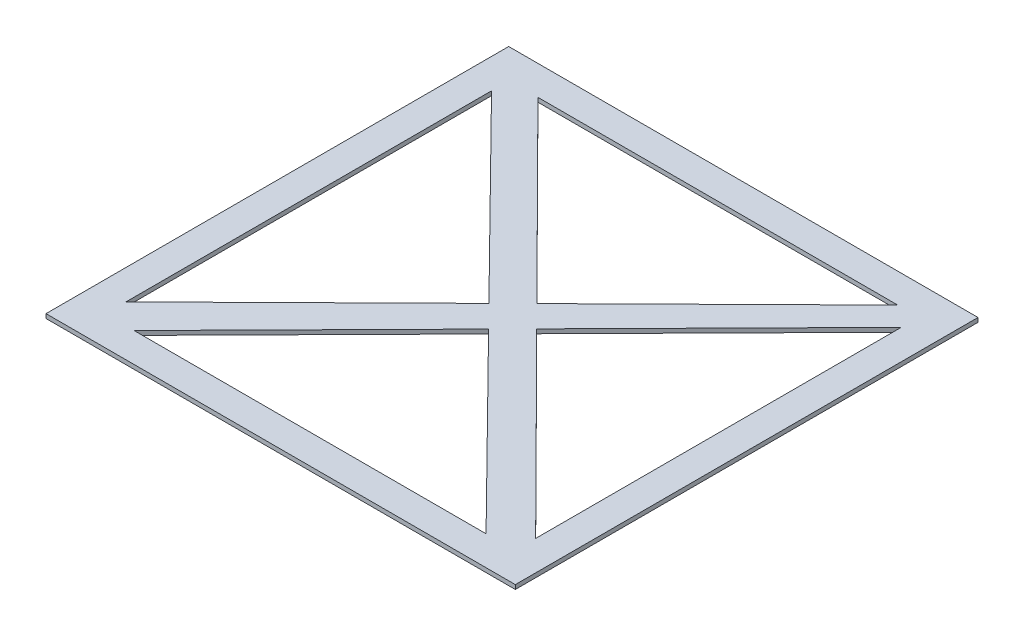
ISO-10303-21;
HEADER;
FILE_DESCRIPTION(('STEP AP214'),'2;1');
FILE_NAME('part.step','',(''),(''),'','','');
FILE_SCHEMA(('AUTOMOTIVE_DESIGN { 1 0 10303 214 1 1 1 1 }'));
ENDSEC;
DATA;
#1=APPLICATION_CONTEXT('core data for automotive mechanical design processes');
#2=APPLICATION_PROTOCOL_DEFINITION('international standard','automotive_design',2000,#1);
#3=PRODUCT_CONTEXT('',#1,'mechanical');
#4=PRODUCT('Part','Part','',(#3));
#5=PRODUCT_RELATED_PRODUCT_CATEGORY('part','',(#4));
#6=PRODUCT_DEFINITION_FORMATION('','',#4);
#7=PRODUCT_DEFINITION_CONTEXT('part definition',#1,'design');
#8=PRODUCT_DEFINITION('design','',#6,#7);
#9=PRODUCT_DEFINITION_SHAPE('','',#8);
#10=(LENGTH_UNIT() NAMED_UNIT(*) SI_UNIT(.MILLI.,.METRE.));
#11=(NAMED_UNIT(*) PLANE_ANGLE_UNIT() SI_UNIT($,.RADIAN.));
#12=(NAMED_UNIT(*) SI_UNIT($,.STERADIAN.) SOLID_ANGLE_UNIT());
#13=UNCERTAINTY_MEASURE_WITH_UNIT(LENGTH_MEASURE(1.E-05),#10,'distance_accuracy_value','');
#14=(GEOMETRIC_REPRESENTATION_CONTEXT(3) GLOBAL_UNCERTAINTY_ASSIGNED_CONTEXT((#13)) GLOBAL_UNIT_ASSIGNED_CONTEXT((#10,
#11,#12)) REPRESENTATION_CONTEXT('',''));
#15=CARTESIAN_POINT('',(0.,0.,0.));
#16=DIRECTION('',(0.,0.,1.));
#17=DIRECTION('',(1.,0.,0.));
#18=AXIS2_PLACEMENT_3D('',#15,#16,#17);
#19=CARTESIAN_POINT('',(0.,20.,0.));
#20=DIRECTION('',(0.,1.,0.));
#21=DIRECTION('',(0.,0.,1.));
#22=AXIS2_PLACEMENT_3D('',#19,#20,#21);
#23=PLANE('',#22);
#24=DIRECTION('',(-1.,0.,0.));
#25=VECTOR('',#24,1.);
#26=CARTESIAN_POINT('',(903.618826821277,20.,-970.686446865544));
#27=LINE('',#26,#25);
#28=CARTESIAN_POINT('',(903.618826821277,20.,-970.686446865544));
#29=VERTEX_POINT('',#28);
#30=CARTESIAN_POINT('',(-1306.34674750349,20.,-970.686446865543));
#31=VERTEX_POINT('',#30);
#32=EDGE_CURVE('E248',#29,#31,#27,.T.);
#33=ORIENTED_EDGE('',*,*,#32,.T.);
#34=DIRECTION('',(0.,0.,1.));
#35=VECTOR('',#34,1.);
#36=CARTESIAN_POINT('',(-1306.34674750349,20.,-970.686446865543));
#37=LINE('',#36,#35);
#38=CARTESIAN_POINT('',(-1306.34674750349,20.,1207.97064135837));
#39=VERTEX_POINT('',#38);
#40=EDGE_CURVE('E251',#31,#39,#37,.T.);
#41=ORIENTED_EDGE('',*,*,#40,.T.);
#42=DIRECTION('',(1.,0.,0.));
#43=VECTOR('',#42,1.);
#44=CARTESIAN_POINT('',(-1306.34674750349,20.,1207.97064135837));
#45=LINE('',#44,#43);
#46=CARTESIAN_POINT('',(903.618826821277,20.,1207.97064135837));
#47=VERTEX_POINT('',#46);
#48=EDGE_CURVE('E254',#39,#47,#45,.T.);
#49=ORIENTED_EDGE('',*,*,#48,.T.);
#50=DIRECTION('',(0.,0.,-1.));
#51=VECTOR('',#50,1.);
#52=CARTESIAN_POINT('',(903.618826821277,20.,1207.97064135837));
#53=LINE('',#52,#51);
#54=EDGE_CURVE('E256',#47,#29,#53,.T.);
#55=ORIENTED_EDGE('',*,*,#54,.T.);
#56=EDGE_LOOP('',(#33,#41,#49,#55));
#57=FACE_BOUND('',#56,.T.);
#58=DIRECTION('',(0.712133167879423,0.,-0.702044408286269));
#59=VECTOR('',#58,1.);
#60=CARTESIAN_POINT('',(-305.329028982993,20.,123.413356765064));
#61=LINE('',#60,#59);
#62=CARTESIAN_POINT('',(-1165.9265992036,20.,971.818878666588));
#63=VERTEX_POINT('',#62);
#64=CARTESIAN_POINT('',(-305.329028982993,20.,123.413356765064));
#65=VERTEX_POINT('',#64);
#66=EDGE_CURVE('E226',#63,#65,#61,.T.);
#67=ORIENTED_EDGE('',*,*,#66,.F.);
#68=DIRECTION('',(0.,0.,1.));
#69=VECTOR('',#68,1.);
#70=CARTESIAN_POINT('',(-1165.9265992036,20.,971.818878666588));
#71=LINE('',#70,#69);
#72=CARTESIAN_POINT('',(-1165.9265992036,20.,-749.551468133354));
#73=VERTEX_POINT('',#72);
#74=EDGE_CURVE('E224',#73,#63,#71,.T.);
#75=ORIENTED_EDGE('',*,*,#74,.F.);
#76=DIRECTION('',(-0.702044408286269,0.,-0.712133167879423));
#77=VECTOR('',#76,1.);
#78=CARTESIAN_POINT('',(-1165.9265992036,20.,-749.551468133354));
#79=LINE('',#78,#77);
#80=EDGE_CURVE('E230',#65,#73,#79,.T.);
#81=ORIENTED_EDGE('',*,*,#80,.F.);
#82=EDGE_LOOP('',(#67,#75,#81));
#83=FACE_BOUND('',#82,.T.);
#84=DIRECTION('',(0.712133167879423,0.,-0.702044408286269));
#85=VECTOR('',#84,1.);
#86=CARTESIAN_POINT('',(664.073434989836,20.,-832.255624694718));
#87=LINE('',#86,#85);
#88=CARTESIAN_POINT('',(-191.599463217418,20.,11.2949928075148));
#89=VERTEX_POINT('',#88);
#90=CARTESIAN_POINT('',(664.073434989836,20.,-832.255624694718));
#91=VERTEX_POINT('',#90);
#92=EDGE_CURVE('E202',#89,#91,#87,.T.);
#93=ORIENTED_EDGE('',*,*,#92,.F.);
#94=DIRECTION('',(0.704989776317227,0.,0.709217466852154));
#95=VECTOR('',#94,1.);
#96=CARTESIAN_POINT('',(-191.599463217418,20.,11.2949928075148));
#97=LINE('',#96,#95);
#98=CARTESIAN_POINT('',(-1030.1216217095,20.,-832.255624694718));
#99=VERTEX_POINT('',#98);
#100=EDGE_CURVE('E200',#99,#89,#97,.T.);
#101=ORIENTED_EDGE('',*,*,#100,.F.);
#102=DIRECTION('',(-1.,0.,0.));
#103=VECTOR('',#102,1.);
#104=CARTESIAN_POINT('',(-1030.1216217095,20.,-832.255624694718));
#105=LINE('',#104,#103);
#106=EDGE_CURVE('E206',#91,#99,#105,.T.);
#107=ORIENTED_EDGE('',*,*,#106,.F.);
#108=EDGE_LOOP('',(#93,#101,#107));
#109=FACE_BOUND('',#108,.T.);
#110=DIRECTION('',(0.,0.,-1.));
#111=VECTOR('',#110,1.);
#112=CARTESIAN_POINT('',(763.19867852139,20.,-749.551468133354));
#113=LINE('',#112,#111);
#114=CARTESIAN_POINT('',(763.19867852139,20.,971.818878666588));
#115=VERTEX_POINT('',#114);
#116=CARTESIAN_POINT('',(763.19867852139,20.,-749.551468133354));
#117=VERTEX_POINT('',#116);
#118=EDGE_CURVE('E178',#115,#117,#113,.T.);
#119=ORIENTED_EDGE('',*,*,#118,.F.);
#120=DIRECTION('',(0.704989776317227,0.,0.709217466852154));
#121=VECTOR('',#120,1.);
#122=CARTESIAN_POINT('',(763.19867852139,20.,971.818878666588));
#123=LINE('',#122,#121);
#124=CARTESIAN_POINT('',(-88.8099143701292,20.,114.700951165054));
#125=VERTEX_POINT('',#124);
#126=EDGE_CURVE('E176',#125,#115,#123,.T.);
#127=ORIENTED_EDGE('',*,*,#126,.F.);
#128=DIRECTION('',(-0.702044408286269,0.,0.712133167879423));
#129=VECTOR('',#128,1.);
#130=CARTESIAN_POINT('',(-88.8099143701292,20.,114.700951165054));
#131=LINE('',#130,#129);
#132=EDGE_CURVE('E182',#117,#125,#131,.T.);
#133=ORIENTED_EDGE('',*,*,#132,.F.);
#134=EDGE_LOOP('',(#119,#127,#133));
#135=FACE_BOUND('',#134,.T.);
#136=DIRECTION('',(-0.702044408286269,0.,0.712133167879423));
#137=VECTOR('',#136,1.);
#138=CARTESIAN_POINT('',(-201.363960341105,20.,228.872459931311));
#139=LINE('',#138,#137);
#140=CARTESIAN_POINT('',(-201.363960341105,20.,228.872459931311));
#141=VERTEX_POINT('',#140);
#142=CARTESIAN_POINT('',(-1030.1216217095,20.,1069.53981918754));
#143=VERTEX_POINT('',#142);
#144=EDGE_CURVE('E157',#141,#143,#139,.T.);
#145=ORIENTED_EDGE('',*,*,#144,.F.);
#146=DIRECTION('',(-0.702044408286269,0.,-0.712133167879423));
#147=VECTOR('',#146,1.);
#148=CARTESIAN_POINT('',(627.393701027293,20.,1069.53981918754));
#149=LINE('',#148,#147);
#150=CARTESIAN_POINT('',(627.393701027293,20.,1069.53981918754));
#151=VERTEX_POINT('',#150);
#152=EDGE_CURVE('E149',#151,#141,#149,.T.);
#153=ORIENTED_EDGE('',*,*,#152,.F.);
#154=DIRECTION('',(1.,0.,0.));
#155=VECTOR('',#154,1.);
#156=CARTESIAN_POINT('',(-1030.1216217095,20.,1069.53981918754));
#157=LINE('',#156,#155);
#158=EDGE_CURVE('E166',#143,#151,#157,.T.);
#159=ORIENTED_EDGE('',*,*,#158,.F.);
#160=EDGE_LOOP('',(#145,#153,#159));
#161=FACE_BOUND('',#160,.T.);
#162=ADVANCED_FACE('F36',(#57,#83,#109,#135,#161),#23,.T.);
#163=CARTESIAN_POINT('',(0.,0.,0.));
#164=DIRECTION('',(0.,1.,0.));
#165=DIRECTION('',(0.,0.,1.));
#166=AXIS2_PLACEMENT_3D('',#163,#164,#165);
#167=PLANE('',#166);
#168=DIRECTION('',(0.704989776317227,0.,0.709217466852154));
#169=VECTOR('',#168,1.);
#170=CARTESIAN_POINT('',(763.19867852139,0.,971.818878666588));
#171=LINE('',#170,#169);
#172=CARTESIAN_POINT('',(-88.8099143701292,0.,114.700951165054));
#173=VERTEX_POINT('',#172);
#174=CARTESIAN_POINT('',(763.19867852139,0.,971.818878666588));
#175=VERTEX_POINT('',#174);
#176=EDGE_CURVE('E164',#173,#175,#171,.T.);
#177=ORIENTED_EDGE('',*,*,#176,.T.);
#178=DIRECTION('',(0.,0.,-1.));
#179=VECTOR('',#178,1.);
#180=CARTESIAN_POINT('',(763.19867852139,0.,-749.551468133354));
#181=LINE('',#180,#179);
#182=CARTESIAN_POINT('',(763.19867852139,0.,-749.551468133354));
#183=VERTEX_POINT('',#182);
#184=EDGE_CURVE('E187',#175,#183,#181,.T.);
#185=ORIENTED_EDGE('',*,*,#184,.T.);
#186=DIRECTION('',(-0.702044408286269,0.,0.712133167879423));
#187=VECTOR('',#186,1.);
#188=CARTESIAN_POINT('',(-88.8099143701292,0.,114.700951165054));
#189=LINE('',#188,#187);
#190=EDGE_CURVE('E179',#183,#173,#189,.T.);
#191=ORIENTED_EDGE('',*,*,#190,.T.);
#192=EDGE_LOOP('',(#177,#185,#191));
#193=FACE_BOUND('',#192,.T.);
#194=DIRECTION('',(0.,0.,1.));
#195=VECTOR('',#194,1.);
#196=CARTESIAN_POINT('',(-1165.9265992036,0.,971.818878666588));
#197=LINE('',#196,#195);
#198=CARTESIAN_POINT('',(-1165.9265992036,0.,-749.551468133354));
#199=VERTEX_POINT('',#198);
#200=CARTESIAN_POINT('',(-1165.9265992036,0.,971.818878666588));
#201=VERTEX_POINT('',#200);
#202=EDGE_CURVE('E223',#199,#201,#197,.T.);
#203=ORIENTED_EDGE('',*,*,#202,.T.);
#204=DIRECTION('',(0.712133167879423,0.,-0.702044408286269));
#205=VECTOR('',#204,1.);
#206=CARTESIAN_POINT('',(-305.329028982993,0.,123.413356765064));
#207=LINE('',#206,#205);
#208=CARTESIAN_POINT('',(-305.329028982993,0.,123.413356765064));
#209=VERTEX_POINT('',#208);
#210=EDGE_CURVE('E235',#201,#209,#207,.T.);
#211=ORIENTED_EDGE('',*,*,#210,.T.);
#212=DIRECTION('',(-0.702044408286269,0.,-0.712133167879423));
#213=VECTOR('',#212,1.);
#214=CARTESIAN_POINT('',(-1165.9265992036,0.,-749.551468133354));
#215=LINE('',#214,#213);
#216=EDGE_CURVE('E227',#209,#199,#215,.T.);
#217=ORIENTED_EDGE('',*,*,#216,.T.);
#218=EDGE_LOOP('',(#203,#211,#217));
#219=FACE_BOUND('',#218,.T.);
#220=DIRECTION('',(-1.,0.,0.));
#221=VECTOR('',#220,1.);
#222=CARTESIAN_POINT('',(903.618826821277,0.,-970.686446865544));
#223=LINE('',#222,#221);
#224=CARTESIAN_POINT('',(903.618826821277,0.,-970.686446865544));
#225=VERTEX_POINT('',#224);
#226=CARTESIAN_POINT('',(-1306.34674750349,0.,-970.686446865543));
#227=VERTEX_POINT('',#226);
#228=EDGE_CURVE('E247',#225,#227,#223,.T.);
#229=ORIENTED_EDGE('',*,*,#228,.F.);
#230=DIRECTION('',(0.,0.,-1.));
#231=VECTOR('',#230,1.);
#232=CARTESIAN_POINT('',(903.618826821277,0.,1207.97064135837));
#233=LINE('',#232,#231);
#234=CARTESIAN_POINT('',(903.618826821277,0.,1207.97064135837));
#235=VERTEX_POINT('',#234);
#236=EDGE_CURVE('E252',#235,#225,#233,.T.);
#237=ORIENTED_EDGE('',*,*,#236,.F.);
#238=DIRECTION('',(1.,0.,0.));
#239=VECTOR('',#238,1.);
#240=CARTESIAN_POINT('',(-1306.34674750349,0.,1207.97064135837));
#241=LINE('',#240,#239);
#242=CARTESIAN_POINT('',(-1306.34674750349,0.,1207.97064135837));
#243=VERTEX_POINT('',#242);
#244=EDGE_CURVE('E263',#243,#235,#241,.T.);
#245=ORIENTED_EDGE('',*,*,#244,.F.);
#246=DIRECTION('',(0.,0.,1.));
#247=VECTOR('',#246,1.);
#248=CARTESIAN_POINT('',(-1306.34674750349,0.,-970.686446865543));
#249=LINE('',#248,#247);
#250=EDGE_CURVE('E261',#227,#243,#249,.T.);
#251=ORIENTED_EDGE('',*,*,#250,.F.);
#252=EDGE_LOOP('',(#229,#237,#245,#251));
#253=FACE_BOUND('',#252,.T.);
#254=DIRECTION('',(0.704989776317227,0.,0.709217466852154));
#255=VECTOR('',#254,1.);
#256=CARTESIAN_POINT('',(-191.599463217418,0.,11.2949928075148));
#257=LINE('',#256,#255);
#258=CARTESIAN_POINT('',(-1030.1216217095,0.,-832.255624694718));
#259=VERTEX_POINT('',#258);
#260=CARTESIAN_POINT('',(-191.599463217418,0.,11.2949928075148));
#261=VERTEX_POINT('',#260);
#262=EDGE_CURVE('E199',#259,#261,#257,.T.);
#263=ORIENTED_EDGE('',*,*,#262,.T.);
#264=DIRECTION('',(0.712133167879423,0.,-0.702044408286269));
#265=VECTOR('',#264,1.);
#266=CARTESIAN_POINT('',(664.073434989836,0.,-832.255624694718));
#267=LINE('',#266,#265);
#268=CARTESIAN_POINT('',(664.073434989836,0.,-832.255624694718));
#269=VERTEX_POINT('',#268);
#270=EDGE_CURVE('E211',#261,#269,#267,.T.);
#271=ORIENTED_EDGE('',*,*,#270,.T.);
#272=DIRECTION('',(-1.,0.,0.));
#273=VECTOR('',#272,1.);
#274=CARTESIAN_POINT('',(-1030.1216217095,0.,-832.255624694718));
#275=LINE('',#274,#273);
#276=EDGE_CURVE('E203',#269,#259,#275,.T.);
#277=ORIENTED_EDGE('',*,*,#276,.T.);
#278=EDGE_LOOP('',(#263,#271,#277));
#279=FACE_BOUND('',#278,.T.);
#280=DIRECTION('',(-0.702044408286269,0.,-0.712133167879423));
#281=VECTOR('',#280,1.);
#282=CARTESIAN_POINT('',(627.393701027293,0.,1069.53981918754));
#283=LINE('',#282,#281);
#284=CARTESIAN_POINT('',(627.393701027293,0.,1069.53981918754));
#285=VERTEX_POINT('',#284);
#286=CARTESIAN_POINT('',(-201.363960341105,0.,228.872459931311));
#287=VERTEX_POINT('',#286);
#288=EDGE_CURVE('E59',#285,#287,#283,.T.);
#289=ORIENTED_EDGE('',*,*,#288,.T.);
#290=DIRECTION('',(-0.702044408286269,0.,0.712133167879423));
#291=VECTOR('',#290,1.);
#292=CARTESIAN_POINT('',(-201.363960341105,0.,228.872459931311));
#293=LINE('',#292,#291);
#294=CARTESIAN_POINT('',(-1030.1216217095,0.,1069.53981918754));
#295=VERTEX_POINT('',#294);
#296=EDGE_CURVE('E163',#287,#295,#293,.T.);
#297=ORIENTED_EDGE('',*,*,#296,.T.);
#298=DIRECTION('',(1.,0.,0.));
#299=VECTOR('',#298,1.);
#300=CARTESIAN_POINT('',(-1030.1216217095,0.,1069.53981918754));
#301=LINE('',#300,#299);
#302=EDGE_CURVE('E158',#295,#285,#301,.T.);
#303=ORIENTED_EDGE('',*,*,#302,.T.);
#304=EDGE_LOOP('',(#289,#297,#303));
#305=FACE_BOUND('',#304,.T.);
#306=ADVANCED_FACE('F281',(#193,#219,#253,#279,#305),#167,.F.);
#307=CARTESIAN_POINT('',(903.618826821277,20.,-970.686446865544));
#308=DIRECTION('',(0.,0.,1.));
#309=DIRECTION('',(1.,0.,0.));
#310=AXIS2_PLACEMENT_3D('',#307,#308,#309);
#311=PLANE('',#310);
#312=ORIENTED_EDGE('',*,*,#228,.T.);
#313=DIRECTION('',(0.,-1.,0.));
#314=VECTOR('',#313,1.);
#315=CARTESIAN_POINT('',(-1306.34674750349,20.,-970.686446865543));
#316=LINE('',#315,#314);
#317=EDGE_CURVE('E11',#31,#227,#316,.T.);
#318=ORIENTED_EDGE('',*,*,#317,.F.);
#319=ORIENTED_EDGE('',*,*,#32,.F.);
#320=DIRECTION('',(0.,-1.,0.));
#321=VECTOR('',#320,1.);
#322=CARTESIAN_POINT('',(903.618826821277,20.,-970.686446865544));
#323=LINE('',#322,#321);
#324=EDGE_CURVE('E258',#29,#225,#323,.T.);
#325=ORIENTED_EDGE('',*,*,#324,.T.);
#326=EDGE_LOOP('',(#312,#318,#319,#325));
#327=FACE_BOUND('',#326,.T.);
#328=ADVANCED_FACE('F38',(#327),#311,.F.);
#329=CARTESIAN_POINT('',(-1306.34674750349,20.,-970.686446865543));
#330=DIRECTION('',(1.,0.,0.));
#331=DIRECTION('',(0.,0.,-1.));
#332=AXIS2_PLACEMENT_3D('',#329,#330,#331);
#333=PLANE('',#332);
#334=ORIENTED_EDGE('',*,*,#250,.T.);
#335=DIRECTION('',(0.,-1.,0.));
#336=VECTOR('',#335,1.);
#337=CARTESIAN_POINT('',(-1306.34674750349,20.,1207.97064135837));
#338=LINE('',#337,#336);
#339=EDGE_CURVE('E44',#39,#243,#338,.T.);
#340=ORIENTED_EDGE('',*,*,#339,.F.);
#341=ORIENTED_EDGE('',*,*,#40,.F.);
#342=ORIENTED_EDGE('',*,*,#317,.T.);
#343=EDGE_LOOP('',(#334,#340,#341,#342));
#344=FACE_BOUND('',#343,.T.);
#345=ADVANCED_FACE('F292',(#344),#333,.F.);
#346=CARTESIAN_POINT('',(-1306.34674750349,20.,1207.97064135837));
#347=DIRECTION('',(0.,0.,-1.));
#348=DIRECTION('',(-1.,0.,0.));
#349=AXIS2_PLACEMENT_3D('',#346,#347,#348);
#350=PLANE('',#349);
#351=ORIENTED_EDGE('',*,*,#244,.T.);
#352=DIRECTION('',(0.,-1.,0.));
#353=VECTOR('',#352,1.);
#354=CARTESIAN_POINT('',(903.618826821277,20.,1207.97064135837));
#355=LINE('',#354,#353);
#356=EDGE_CURVE('E268',#47,#235,#355,.T.);
#357=ORIENTED_EDGE('',*,*,#356,.F.);
#358=ORIENTED_EDGE('',*,*,#48,.F.);
#359=ORIENTED_EDGE('',*,*,#339,.T.);
#360=EDGE_LOOP('',(#351,#357,#358,#359));
#361=FACE_BOUND('',#360,.T.);
#362=ADVANCED_FACE('F275',(#361),#350,.F.);
#363=CARTESIAN_POINT('',(903.618826821277,20.,1207.97064135837));
#364=DIRECTION('',(-1.,0.,0.));
#365=DIRECTION('',(0.,0.,1.));
#366=AXIS2_PLACEMENT_3D('',#363,#364,#365);
#367=PLANE('',#366);
#368=ORIENTED_EDGE('',*,*,#236,.T.);
#369=ORIENTED_EDGE('',*,*,#324,.F.);
#370=ORIENTED_EDGE('',*,*,#54,.F.);
#371=ORIENTED_EDGE('',*,*,#356,.T.);
#372=EDGE_LOOP('',(#368,#369,#370,#371));
#373=FACE_BOUND('',#372,.T.);
#374=ADVANCED_FACE('F285',(#373),#367,.F.);
#375=CARTESIAN_POINT('',(-1165.9265992036,20.,971.818878666588));
#376=DIRECTION('',(1.,0.,0.));
#377=DIRECTION('',(0.,0.,-1.));
#378=AXIS2_PLACEMENT_3D('',#375,#376,#377);
#379=PLANE('',#378);
#380=ORIENTED_EDGE('',*,*,#202,.F.);
#381=DIRECTION('',(0.,-1.,0.));
#382=VECTOR('',#381,1.);
#383=CARTESIAN_POINT('',(-1165.9265992036,20.,-749.551468133354));
#384=LINE('',#383,#382);
#385=EDGE_CURVE('E232',#73,#199,#384,.T.);
#386=ORIENTED_EDGE('',*,*,#385,.F.);
#387=ORIENTED_EDGE('',*,*,#74,.T.);
#388=DIRECTION('',(0.,-1.,0.));
#389=VECTOR('',#388,1.);
#390=CARTESIAN_POINT('',(-1165.9265992036,20.,971.818878666588));
#391=LINE('',#390,#389);
#392=EDGE_CURVE('E244',#63,#201,#391,.T.);
#393=ORIENTED_EDGE('',*,*,#392,.T.);
#394=EDGE_LOOP('',(#380,#386,#387,#393));
#395=FACE_BOUND('',#394,.T.);
#396=ADVANCED_FACE('F307',(#395),#379,.T.);
#397=CARTESIAN_POINT('',(-305.329028982993,20.,123.413356765064));
#398=DIRECTION('',(-0.702044408286269,0.,-0.712133167879423));
#399=DIRECTION('',(-0.712133167879423,0.,0.702044408286269));
#400=AXIS2_PLACEMENT_3D('',#397,#398,#399);
#401=PLANE('',#400);
#402=ORIENTED_EDGE('',*,*,#210,.F.);
#403=ORIENTED_EDGE('',*,*,#392,.F.);
#404=ORIENTED_EDGE('',*,*,#66,.T.);
#405=DIRECTION('',(0.,-1.,0.));
#406=VECTOR('',#405,1.);
#407=CARTESIAN_POINT('',(-305.329028982993,20.,123.413356765064));
#408=LINE('',#407,#406);
#409=EDGE_CURVE('E242',#65,#209,#408,.T.);
#410=ORIENTED_EDGE('',*,*,#409,.T.);
#411=EDGE_LOOP('',(#402,#403,#404,#410));
#412=FACE_BOUND('',#411,.T.);
#413=ADVANCED_FACE('F314',(#412),#401,.T.);
#414=CARTESIAN_POINT('',(-1165.9265992036,20.,-749.551468133354));
#415=DIRECTION('',(-0.712133167879423,0.,0.702044408286269));
#416=DIRECTION('',(0.702044408286269,0.,0.712133167879423));
#417=AXIS2_PLACEMENT_3D('',#414,#415,#416);
#418=PLANE('',#417);
#419=ORIENTED_EDGE('',*,*,#216,.F.);
#420=ORIENTED_EDGE('',*,*,#409,.F.);
#421=ORIENTED_EDGE('',*,*,#80,.T.);
#422=ORIENTED_EDGE('',*,*,#385,.T.);
#423=EDGE_LOOP('',(#419,#420,#421,#422));
#424=FACE_BOUND('',#423,.T.);
#425=ADVANCED_FACE('F319',(#424),#418,.T.);
#426=CARTESIAN_POINT('',(-191.599463217418,20.,11.2949928075148));
#427=DIRECTION('',(0.709217466852154,0.,-0.704989776317227));
#428=DIRECTION('',(-0.704989776317227,0.,-0.709217466852154));
#429=AXIS2_PLACEMENT_3D('',#426,#427,#428);
#430=PLANE('',#429);
#431=ORIENTED_EDGE('',*,*,#262,.F.);
#432=DIRECTION('',(0.,-1.,0.));
#433=VECTOR('',#432,1.);
#434=CARTESIAN_POINT('',(-1030.1216217095,20.,-832.255624694718));
#435=LINE('',#434,#433);
#436=EDGE_CURVE('E208',#99,#259,#435,.T.);
#437=ORIENTED_EDGE('',*,*,#436,.F.);
#438=ORIENTED_EDGE('',*,*,#100,.T.);
#439=DIRECTION('',(0.,-1.,0.));
#440=VECTOR('',#439,1.);
#441=CARTESIAN_POINT('',(-191.599463217418,20.,11.2949928075148));
#442=LINE('',#441,#440);
#443=EDGE_CURVE('E220',#89,#261,#442,.T.);
#444=ORIENTED_EDGE('',*,*,#443,.T.);
#445=EDGE_LOOP('',(#431,#437,#438,#444));
#446=FACE_BOUND('',#445,.T.);
#447=ADVANCED_FACE('F365',(#446),#430,.T.);
#448=CARTESIAN_POINT('',(664.073434989836,20.,-832.255624694718));
#449=DIRECTION('',(-0.702044408286269,0.,-0.712133167879423));
#450=DIRECTION('',(-0.712133167879423,0.,0.702044408286269));
#451=AXIS2_PLACEMENT_3D('',#448,#449,#450);
#452=PLANE('',#451);
#453=ORIENTED_EDGE('',*,*,#270,.F.);
#454=ORIENTED_EDGE('',*,*,#443,.F.);
#455=ORIENTED_EDGE('',*,*,#92,.T.);
#456=DIRECTION('',(0.,-1.,0.));
#457=VECTOR('',#456,1.);
#458=CARTESIAN_POINT('',(664.073434989836,20.,-832.255624694718));
#459=LINE('',#458,#457);
#460=EDGE_CURVE('E218',#91,#269,#459,.T.);
#461=ORIENTED_EDGE('',*,*,#460,.T.);
#462=EDGE_LOOP('',(#453,#454,#455,#461));
#463=FACE_BOUND('',#462,.T.);
#464=ADVANCED_FACE('F361',(#463),#452,.T.);
#465=CARTESIAN_POINT('',(-1030.1216217095,20.,-832.255624694718));
#466=DIRECTION('',(0.,0.,1.));
#467=DIRECTION('',(1.,0.,0.));
#468=AXIS2_PLACEMENT_3D('',#465,#466,#467);
#469=PLANE('',#468);
#470=ORIENTED_EDGE('',*,*,#276,.F.);
#471=ORIENTED_EDGE('',*,*,#460,.F.);
#472=ORIENTED_EDGE('',*,*,#106,.T.);
#473=ORIENTED_EDGE('',*,*,#436,.T.);
#474=EDGE_LOOP('',(#470,#471,#472,#473));
#475=FACE_BOUND('',#474,.T.);
#476=ADVANCED_FACE('F358',(#475),#469,.T.);
#477=CARTESIAN_POINT('',(763.19867852139,20.,971.818878666588));
#478=DIRECTION('',(0.709217466852154,0.,-0.704989776317227));
#479=DIRECTION('',(-0.704989776317227,0.,-0.709217466852154));
#480=AXIS2_PLACEMENT_3D('',#477,#478,#479);
#481=PLANE('',#480);
#482=ORIENTED_EDGE('',*,*,#176,.F.);
#483=DIRECTION('',(0.,-1.,0.));
#484=VECTOR('',#483,1.);
#485=CARTESIAN_POINT('',(-88.8099143701292,20.,114.700951165054));
#486=LINE('',#485,#484);
#487=EDGE_CURVE('E184',#125,#173,#486,.T.);
#488=ORIENTED_EDGE('',*,*,#487,.F.);
#489=ORIENTED_EDGE('',*,*,#126,.T.);
#490=DIRECTION('',(0.,-1.,0.));
#491=VECTOR('',#490,1.);
#492=CARTESIAN_POINT('',(763.19867852139,20.,971.818878666588));
#493=LINE('',#492,#491);
#494=EDGE_CURVE('E196',#115,#175,#493,.T.);
#495=ORIENTED_EDGE('',*,*,#494,.T.);
#496=EDGE_LOOP('',(#482,#488,#489,#495));
#497=FACE_BOUND('',#496,.T.);
#498=ADVANCED_FACE('F342',(#497),#481,.T.);
#499=CARTESIAN_POINT('',(763.19867852139,20.,-749.551468133354));
#500=DIRECTION('',(-1.,0.,0.));
#501=DIRECTION('',(0.,0.,1.));
#502=AXIS2_PLACEMENT_3D('',#499,#500,#501);
#503=PLANE('',#502);
#504=ORIENTED_EDGE('',*,*,#184,.F.);
#505=ORIENTED_EDGE('',*,*,#494,.F.);
#506=ORIENTED_EDGE('',*,*,#118,.T.);
#507=DIRECTION('',(0.,-1.,0.));
#508=VECTOR('',#507,1.);
#509=CARTESIAN_POINT('',(763.19867852139,20.,-749.551468133354));
#510=LINE('',#509,#508);
#511=EDGE_CURVE('E194',#117,#183,#510,.T.);
#512=ORIENTED_EDGE('',*,*,#511,.T.);
#513=EDGE_LOOP('',(#504,#505,#506,#512));
#514=FACE_BOUND('',#513,.T.);
#515=ADVANCED_FACE('F339',(#514),#503,.T.);
#516=CARTESIAN_POINT('',(-88.8099143701292,20.,114.700951165054));
#517=DIRECTION('',(0.712133167879423,0.,0.702044408286269));
#518=DIRECTION('',(0.702044408286269,0.,-0.712133167879423));
#519=AXIS2_PLACEMENT_3D('',#516,#517,#518);
#520=PLANE('',#519);
#521=ORIENTED_EDGE('',*,*,#190,.F.);
#522=ORIENTED_EDGE('',*,*,#511,.F.);
#523=ORIENTED_EDGE('',*,*,#132,.T.);
#524=ORIENTED_EDGE('',*,*,#487,.T.);
#525=EDGE_LOOP('',(#521,#522,#523,#524));
#526=FACE_BOUND('',#525,.T.);
#527=ADVANCED_FACE('F345',(#526),#520,.T.);
#528=CARTESIAN_POINT('',(627.393701027293,20.,1069.53981918754));
#529=DIRECTION('',(-0.712133167879423,0.,0.702044408286269));
#530=DIRECTION('',(0.702044408286269,0.,0.712133167879423));
#531=AXIS2_PLACEMENT_3D('',#528,#529,#530);
#532=PLANE('',#531);
#533=ORIENTED_EDGE('',*,*,#288,.F.);
#534=DIRECTION('',(0.,-1.,0.));
#535=VECTOR('',#534,1.);
#536=CARTESIAN_POINT('',(627.393701027293,20.,1069.53981918754));
#537=LINE('',#536,#535);
#538=EDGE_CURVE('E153',#151,#285,#537,.T.);
#539=ORIENTED_EDGE('',*,*,#538,.F.);
#540=ORIENTED_EDGE('',*,*,#152,.T.);
#541=DIRECTION('',(0.,-1.,0.));
#542=VECTOR('',#541,1.);
#543=CARTESIAN_POINT('',(-201.363960341105,20.,228.872459931311));
#544=LINE('',#543,#542);
#545=EDGE_CURVE('E152',#141,#287,#544,.T.);
#546=ORIENTED_EDGE('',*,*,#545,.T.);
#547=EDGE_LOOP('',(#533,#539,#540,#546));
#548=FACE_BOUND('',#547,.T.);
#549=ADVANCED_FACE('F151',(#548),#532,.T.);
#550=CARTESIAN_POINT('',(-201.363960341105,20.,228.872459931311));
#551=DIRECTION('',(0.712133167879423,0.,0.702044408286269));
#552=DIRECTION('',(0.702044408286269,0.,-0.712133167879423));
#553=AXIS2_PLACEMENT_3D('',#550,#551,#552);
#554=PLANE('',#553);
#555=ORIENTED_EDGE('',*,*,#296,.F.);
#556=ORIENTED_EDGE('',*,*,#545,.F.);
#557=ORIENTED_EDGE('',*,*,#144,.T.);
#558=DIRECTION('',(0.,-1.,0.));
#559=VECTOR('',#558,1.);
#560=CARTESIAN_POINT('',(-1030.1216217095,20.,1069.53981918754));
#561=LINE('',#560,#559);
#562=EDGE_CURVE('E51',#143,#295,#561,.T.);
#563=ORIENTED_EDGE('',*,*,#562,.T.);
#564=EDGE_LOOP('',(#555,#556,#557,#563));
#565=FACE_BOUND('',#564,.T.);
#566=ADVANCED_FACE('F161',(#565),#554,.T.);
#567=CARTESIAN_POINT('',(-1030.1216217095,20.,1069.53981918754));
#568=DIRECTION('',(0.,0.,-1.));
#569=DIRECTION('',(-1.,0.,0.));
#570=AXIS2_PLACEMENT_3D('',#567,#568,#569);
#571=PLANE('',#570);
#572=ORIENTED_EDGE('',*,*,#302,.F.);
#573=ORIENTED_EDGE('',*,*,#562,.F.);
#574=ORIENTED_EDGE('',*,*,#158,.T.);
#575=ORIENTED_EDGE('',*,*,#538,.T.);
#576=EDGE_LOOP('',(#572,#573,#574,#575));
#577=FACE_BOUND('',#576,.T.);
#578=ADVANCED_FACE('F414',(#577),#571,.T.);
#579=CLOSED_SHELL('',(#162,#306,#328,#345,#362,#374,#396,#413,#425,#447,#464,#476,#498,#515,
#527,#549,#566,#578));
#580=MANIFOLD_SOLID_BREP('B2',#579);
#581=ADVANCED_BREP_SHAPE_REPRESENTATION('',(#18,#580),#14);
#582=SHAPE_DEFINITION_REPRESENTATION(#9,#581);
ENDSEC;
END-ISO-10303-21;
